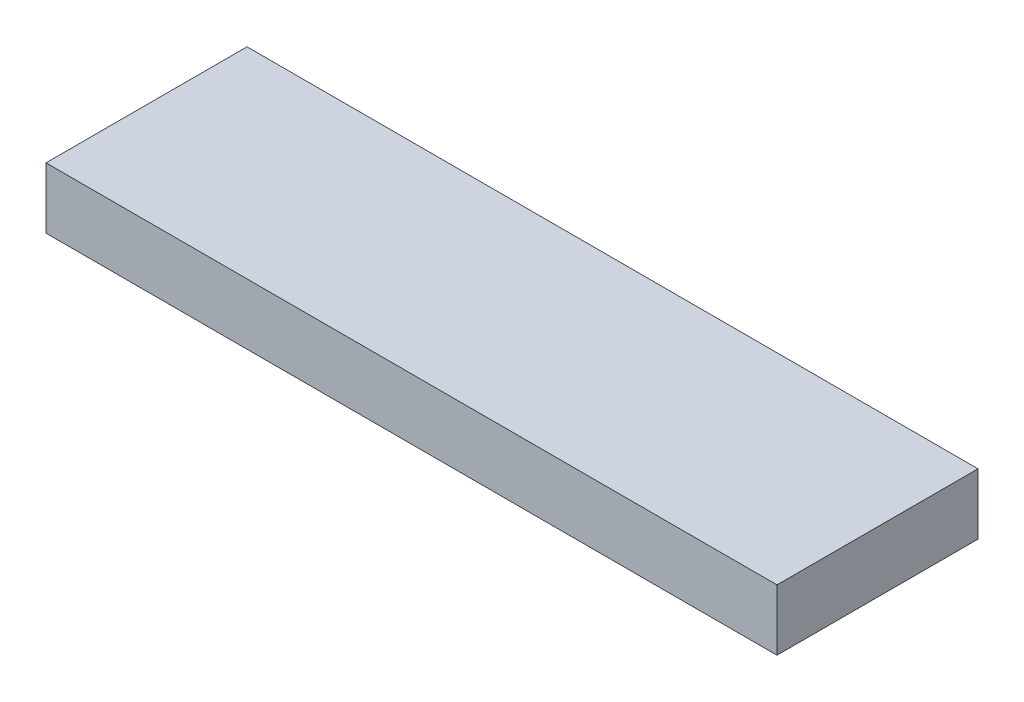
ISO-10303-21;
HEADER;
FILE_DESCRIPTION(('STEP AP214'),'2;1');
FILE_NAME('part.step','',(''),(''),'','','');
FILE_SCHEMA(('AUTOMOTIVE_DESIGN { 1 0 10303 214 1 1 1 1 }'));
ENDSEC;
DATA;
#1=APPLICATION_CONTEXT('core data for automotive mechanical design processes');
#2=APPLICATION_PROTOCOL_DEFINITION('international standard','automotive_design',2000,#1);
#3=PRODUCT_CONTEXT('',#1,'mechanical');
#4=PRODUCT('Part','Part','',(#3));
#5=PRODUCT_RELATED_PRODUCT_CATEGORY('part','',(#4));
#6=PRODUCT_DEFINITION_FORMATION('','',#4);
#7=PRODUCT_DEFINITION_CONTEXT('part definition',#1,'design');
#8=PRODUCT_DEFINITION('design','',#6,#7);
#9=PRODUCT_DEFINITION_SHAPE('','',#8);
#10=(LENGTH_UNIT() NAMED_UNIT(*) SI_UNIT(.MILLI.,.METRE.));
#11=(NAMED_UNIT(*) PLANE_ANGLE_UNIT() SI_UNIT($,.RADIAN.));
#12=(NAMED_UNIT(*) SI_UNIT($,.STERADIAN.) SOLID_ANGLE_UNIT());
#13=UNCERTAINTY_MEASURE_WITH_UNIT(LENGTH_MEASURE(1.E-05),#10,'distance_accuracy_value','');
#14=(GEOMETRIC_REPRESENTATION_CONTEXT(3) GLOBAL_UNCERTAINTY_ASSIGNED_CONTEXT((#13)) GLOBAL_UNIT_ASSIGNED_CONTEXT((#10,
#11,#12)) REPRESENTATION_CONTEXT('',''));
#15=CARTESIAN_POINT('',(0.,0.,0.));
#16=DIRECTION('',(0.,0.,1.));
#17=DIRECTION('',(1.,0.,0.));
#18=AXIS2_PLACEMENT_3D('',#15,#16,#17);
#19=CARTESIAN_POINT('',(0.,10.,0.));
#20=DIRECTION('',(1.,0.,0.));
#21=DIRECTION('',(0.,0.,-1.));
#22=AXIS2_PLACEMENT_3D('',#19,#20,#21);
#23=PLANE('',#22);
#24=DIRECTION('',(0.,0.,1.));
#25=VECTOR('',#24,1.);
#26=CARTESIAN_POINT('',(0.,0.,0.));
#27=LINE('',#26,#25);
#28=CARTESIAN_POINT('',(0.,0.,-33.));
#29=VERTEX_POINT('',#28);
#30=CARTESIAN_POINT('',(0.,0.,0.));
#31=VERTEX_POINT('',#30);
#32=EDGE_CURVE('E105',#29,#31,#27,.T.);
#33=ORIENTED_EDGE('',*,*,#32,.T.);
#34=DIRECTION('',(0.,-1.,0.));
#35=VECTOR('',#34,1.);
#36=CARTESIAN_POINT('',(0.,10.,0.));
#37=LINE('',#36,#35);
#38=CARTESIAN_POINT('',(0.,10.,0.));
#39=VERTEX_POINT('',#38);
#40=EDGE_CURVE('E11',#39,#31,#37,.T.);
#41=ORIENTED_EDGE('',*,*,#40,.F.);
#42=DIRECTION('',(0.,0.,1.));
#43=VECTOR('',#42,1.);
#44=CARTESIAN_POINT('',(0.,10.,0.));
#45=LINE('',#44,#43);
#46=CARTESIAN_POINT('',(0.,10.,-33.));
#47=VERTEX_POINT('',#46);
#48=EDGE_CURVE('E89',#47,#39,#45,.T.);
#49=ORIENTED_EDGE('',*,*,#48,.F.);
#50=DIRECTION('',(0.,-1.,0.));
#51=VECTOR('',#50,1.);
#52=CARTESIAN_POINT('',(0.,10.,-33.));
#53=LINE('',#52,#51);
#54=EDGE_CURVE('E101',#47,#29,#53,.T.);
#55=ORIENTED_EDGE('',*,*,#54,.T.);
#56=EDGE_LOOP('',(#33,#41,#49,#55));
#57=FACE_BOUND('',#56,.T.);
#58=ADVANCED_FACE('F37',(#57),#23,.F.);
#59=CARTESIAN_POINT('',(0.,10.,0.));
#60=DIRECTION('',(0.,0.,-1.));
#61=DIRECTION('',(-1.,0.,0.));
#62=AXIS2_PLACEMENT_3D('',#59,#60,#61);
#63=PLANE('',#62);
#64=DIRECTION('',(1.,0.,0.));
#65=VECTOR('',#64,1.);
#66=CARTESIAN_POINT('',(0.,0.,0.));
#67=LINE('',#66,#65);
#68=CARTESIAN_POINT('',(120.,0.,0.));
#69=VERTEX_POINT('',#68);
#70=EDGE_CURVE('E94',#31,#69,#67,.T.);
#71=ORIENTED_EDGE('',*,*,#70,.T.);
#72=DIRECTION('',(0.,-1.,0.));
#73=VECTOR('',#72,1.);
#74=CARTESIAN_POINT('',(120.,10.,0.));
#75=LINE('',#74,#73);
#76=CARTESIAN_POINT('',(120.,10.,0.));
#77=VERTEX_POINT('',#76);
#78=EDGE_CURVE('E46',#77,#69,#75,.T.);
#79=ORIENTED_EDGE('',*,*,#78,.F.);
#80=DIRECTION('',(1.,0.,0.));
#81=VECTOR('',#80,1.);
#82=CARTESIAN_POINT('',(0.,10.,0.));
#83=LINE('',#82,#81);
#84=EDGE_CURVE('E84',#39,#77,#83,.T.);
#85=ORIENTED_EDGE('',*,*,#84,.F.);
#86=ORIENTED_EDGE('',*,*,#40,.T.);
#87=EDGE_LOOP('',(#71,#79,#85,#86));
#88=FACE_BOUND('',#87,.T.);
#89=ADVANCED_FACE('F93',(#88),#63,.F.);
#90=CARTESIAN_POINT('',(120.,10.,0.));
#91=DIRECTION('',(-1.,0.,0.));
#92=DIRECTION('',(0.,0.,1.));
#93=AXIS2_PLACEMENT_3D('',#90,#91,#92);
#94=PLANE('',#93);
#95=DIRECTION('',(0.,0.,-1.));
#96=VECTOR('',#95,1.);
#97=CARTESIAN_POINT('',(120.,0.,0.));
#98=LINE('',#97,#96);
#99=CARTESIAN_POINT('',(120.,0.,-33.));
#100=VERTEX_POINT('',#99);
#101=EDGE_CURVE('E71',#69,#100,#98,.T.);
#102=ORIENTED_EDGE('',*,*,#101,.T.);
#103=DIRECTION('',(0.,-1.,0.));
#104=VECTOR('',#103,1.);
#105=CARTESIAN_POINT('',(120.,10.,-33.));
#106=LINE('',#105,#104);
#107=CARTESIAN_POINT('',(120.,10.,-33.));
#108=VERTEX_POINT('',#107);
#109=EDGE_CURVE('E96',#108,#100,#106,.T.);
#110=ORIENTED_EDGE('',*,*,#109,.F.);
#111=DIRECTION('',(0.,0.,-1.));
#112=VECTOR('',#111,1.);
#113=CARTESIAN_POINT('',(120.,10.,0.));
#114=LINE('',#113,#112);
#115=EDGE_CURVE('E87',#77,#108,#114,.T.);
#116=ORIENTED_EDGE('',*,*,#115,.F.);
#117=ORIENTED_EDGE('',*,*,#78,.T.);
#118=EDGE_LOOP('',(#102,#110,#116,#117));
#119=FACE_BOUND('',#118,.T.);
#120=ADVANCED_FACE('F97',(#119),#94,.F.);
#121=CARTESIAN_POINT('',(0.,10.,-33.));
#122=DIRECTION('',(0.,0.,1.));
#123=DIRECTION('',(1.,0.,0.));
#124=AXIS2_PLACEMENT_3D('',#121,#122,#123);
#125=PLANE('',#124);
#126=DIRECTION('',(-1.,0.,0.));
#127=VECTOR('',#126,1.);
#128=CARTESIAN_POINT('',(0.,0.,-33.));
#129=LINE('',#128,#127);
#130=EDGE_CURVE('E77',#100,#29,#129,.T.);
#131=ORIENTED_EDGE('',*,*,#130,.T.);
#132=ORIENTED_EDGE('',*,*,#54,.F.);
#133=DIRECTION('',(-1.,0.,0.));
#134=VECTOR('',#133,1.);
#135=CARTESIAN_POINT('',(0.,10.,-33.));
#136=LINE('',#135,#134);
#137=EDGE_CURVE('E54',#108,#47,#136,.T.);
#138=ORIENTED_EDGE('',*,*,#137,.F.);
#139=ORIENTED_EDGE('',*,*,#109,.T.);
#140=EDGE_LOOP('',(#131,#132,#138,#139));
#141=FACE_BOUND('',#140,.T.);
#142=ADVANCED_FACE('F118',(#141),#125,.F.);
#143=CARTESIAN_POINT('',(0.,10.,0.));
#144=DIRECTION('',(0.,-1.,0.));
#145=DIRECTION('',(0.,0.,-1.));
#146=AXIS2_PLACEMENT_3D('',#143,#144,#145);
#147=PLANE('',#146);
#148=ORIENTED_EDGE('',*,*,#48,.T.);
#149=ORIENTED_EDGE('',*,*,#84,.T.);
#150=ORIENTED_EDGE('',*,*,#115,.T.);
#151=ORIENTED_EDGE('',*,*,#137,.T.);
#152=EDGE_LOOP('',(#148,#149,#150,#151));
#153=FACE_BOUND('',#152,.T.);
#154=ADVANCED_FACE('F85',(#153),#147,.F.);
#155=CARTESIAN_POINT('',(0.,0.,0.));
#156=DIRECTION('',(0.,-1.,0.));
#157=DIRECTION('',(0.,0.,-1.));
#158=AXIS2_PLACEMENT_3D('',#155,#156,#157);
#159=PLANE('',#158);
#160=ORIENTED_EDGE('',*,*,#32,.F.);
#161=ORIENTED_EDGE('',*,*,#130,.F.);
#162=ORIENTED_EDGE('',*,*,#101,.F.);
#163=ORIENTED_EDGE('',*,*,#70,.F.);
#164=EDGE_LOOP('',(#160,#161,#162,#163));
#165=FACE_BOUND('',#164,.T.);
#166=ADVANCED_FACE('F121',(#165),#159,.T.);
#167=CLOSED_SHELL('',(#58,#89,#120,#142,#154,#166));
#168=MANIFOLD_SOLID_BREP('B2',#167);
#169=ADVANCED_BREP_SHAPE_REPRESENTATION('',(#18,#168),#14);
#170=SHAPE_DEFINITION_REPRESENTATION(#9,#169);
ENDSEC;
END-ISO-10303-21;
